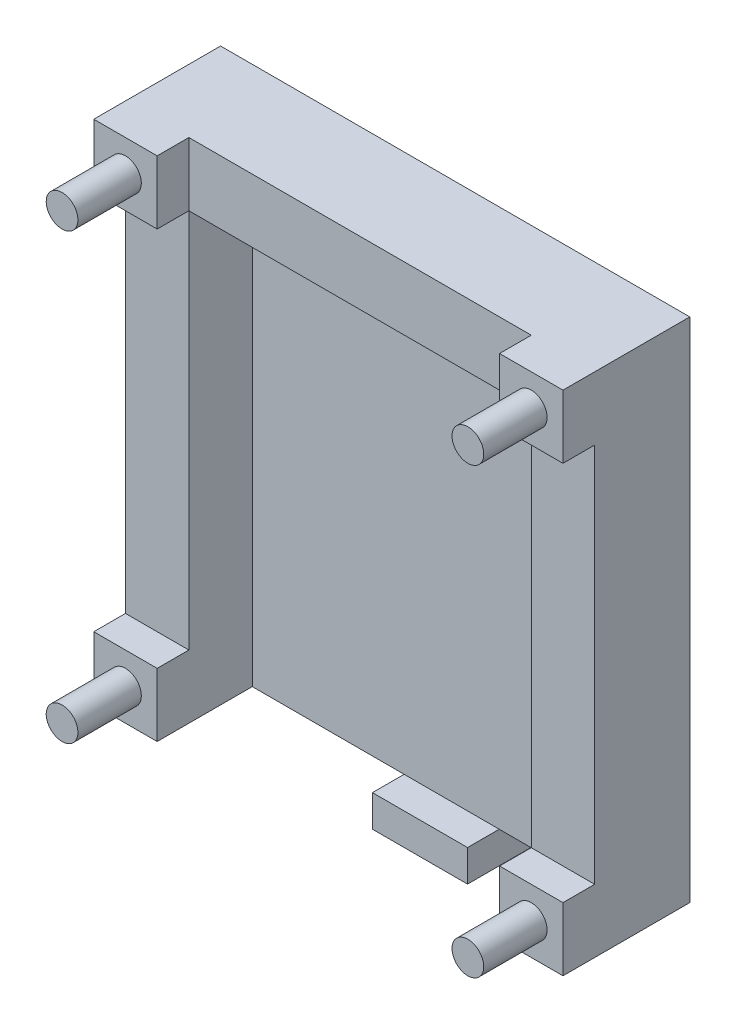
ISO-10303-21;
HEADER;
FILE_DESCRIPTION(('STEP AP214'),'2;1');
FILE_NAME('part.step','',(''),(''),'','','');
FILE_SCHEMA(('AUTOMOTIVE_DESIGN { 1 0 10303 214 1 1 1 1 }'));
ENDSEC;
DATA;
#1=APPLICATION_CONTEXT('core data for automotive mechanical design processes');
#2=APPLICATION_PROTOCOL_DEFINITION('international standard','automotive_design',2000,#1);
#3=PRODUCT_CONTEXT('',#1,'mechanical');
#4=PRODUCT('Part','Part','',(#3));
#5=PRODUCT_RELATED_PRODUCT_CATEGORY('part','',(#4));
#6=PRODUCT_DEFINITION_FORMATION('','',#4);
#7=PRODUCT_DEFINITION_CONTEXT('part definition',#1,'design');
#8=PRODUCT_DEFINITION('design','',#6,#7);
#9=PRODUCT_DEFINITION_SHAPE('','',#8);
#10=(LENGTH_UNIT() NAMED_UNIT(*) SI_UNIT(.MILLI.,.METRE.));
#11=(NAMED_UNIT(*) PLANE_ANGLE_UNIT() SI_UNIT($,.RADIAN.));
#12=(NAMED_UNIT(*) SI_UNIT($,.STERADIAN.) SOLID_ANGLE_UNIT());
#13=UNCERTAINTY_MEASURE_WITH_UNIT(LENGTH_MEASURE(1.E-05),#10,'distance_accuracy_value','');
#14=(GEOMETRIC_REPRESENTATION_CONTEXT(3) GLOBAL_UNCERTAINTY_ASSIGNED_CONTEXT((#13)) GLOBAL_UNIT_ASSIGNED_CONTEXT((#10,
#11,#12)) REPRESENTATION_CONTEXT('',''));
#15=CARTESIAN_POINT('',(0.,0.,0.));
#16=DIRECTION('',(0.,0.,1.));
#17=DIRECTION('',(1.,0.,0.));
#18=AXIS2_PLACEMENT_3D('',#15,#16,#17);
#19=CARTESIAN_POINT('',(0.,-38.4913625304137,10.));
#20=DIRECTION('',(0.,1.,0.));
#21=DIRECTION('',(-1.,0.,0.));
#22=AXIS2_PLACEMENT_3D('',#19,#20,#21);
#23=PLANE('',#22);
#24=DIRECTION('',(1.,0.,0.));
#25=VECTOR('',#24,1.);
#26=CARTESIAN_POINT('',(0.,-38.4913625304137,0.));
#27=LINE('',#26,#25);
#28=CARTESIAN_POINT('',(25.3489672837016,-38.4913625304136,0.));
#29=VERTEX_POINT('',#28);
#30=CARTESIAN_POINT('',(40.3489672837016,-38.4913625304136,0.));
#31=VERTEX_POINT('',#30);
#32=EDGE_CURVE('E111',#29,#31,#27,.T.);
#33=ORIENTED_EDGE('',*,*,#32,.T.);
#34=DIRECTION('',(0.,0.,-1.));
#35=VECTOR('',#34,1.);
#36=CARTESIAN_POINT('',(40.3489672837016,-38.4913625304136,10.));
#37=LINE('',#36,#35);
#38=CARTESIAN_POINT('',(40.3489672837016,-38.4913625304136,10.));
#39=VERTEX_POINT('',#38);
#40=EDGE_CURVE('E12',#39,#31,#37,.T.);
#41=ORIENTED_EDGE('',*,*,#40,.F.);
#42=DIRECTION('',(1.,0.,0.));
#43=VECTOR('',#42,1.);
#44=CARTESIAN_POINT('',(0.,-38.4913625304137,10.));
#45=LINE('',#44,#43);
#46=CARTESIAN_POINT('',(25.3489672837016,-38.4913625304136,10.));
#47=VERTEX_POINT('',#46);
#48=EDGE_CURVE('E106',#47,#39,#45,.T.);
#49=ORIENTED_EDGE('',*,*,#48,.F.);
#50=DIRECTION('',(0.,0.,-1.));
#51=VECTOR('',#50,1.);
#52=CARTESIAN_POINT('',(25.3489672837016,-38.4913625304136,10.));
#53=LINE('',#52,#51);
#54=EDGE_CURVE('E50',#47,#29,#53,.T.);
#55=ORIENTED_EDGE('',*,*,#54,.T.);
#56=EDGE_LOOP('',(#33,#41,#49,#55));
#57=FACE_BOUND('',#56,.T.);
#58=ADVANCED_FACE('F47',(#57),#23,.F.);
#59=CARTESIAN_POINT('',(40.3489672837016,0.,10.));
#60=DIRECTION('',(-1.,0.,0.));
#61=DIRECTION('',(0.,0.,1.));
#62=AXIS2_PLACEMENT_3D('',#59,#60,#61);
#63=PLANE('',#62);
#64=DIRECTION('',(0.,1.,0.));
#65=VECTOR('',#64,1.);
#66=CARTESIAN_POINT('',(40.3489672837016,0.,0.));
#67=LINE('',#66,#65);
#68=CARTESIAN_POINT('',(40.3489672837016,-33.4913625304136,0.));
#69=VERTEX_POINT('',#68);
#70=EDGE_CURVE('E78',#31,#69,#67,.T.);
#71=ORIENTED_EDGE('',*,*,#70,.T.);
#72=DIRECTION('',(0.,0.,-1.));
#73=VECTOR('',#72,1.);
#74=CARTESIAN_POINT('',(40.3489672837016,-33.4913625304136,10.));
#75=LINE('',#74,#73);
#76=CARTESIAN_POINT('',(40.3489672837016,-33.4913625304136,10.));
#77=VERTEX_POINT('',#76);
#78=EDGE_CURVE('E56',#77,#69,#75,.T.);
#79=ORIENTED_EDGE('',*,*,#78,.F.);
#80=DIRECTION('',(0.,1.,0.));
#81=VECTOR('',#80,1.);
#82=CARTESIAN_POINT('',(40.3489672837016,0.,10.));
#83=LINE('',#82,#81);
#84=EDGE_CURVE('E64',#39,#77,#83,.T.);
#85=ORIENTED_EDGE('',*,*,#84,.F.);
#86=ORIENTED_EDGE('',*,*,#40,.T.);
#87=EDGE_LOOP('',(#71,#79,#85,#86));
#88=FACE_BOUND('',#87,.T.);
#89=ADVANCED_FACE('F121',(#88),#63,.F.);
#90=CARTESIAN_POINT('',(0.,-33.4913625304136,10.));
#91=DIRECTION('',(0.,-1.,0.));
#92=DIRECTION('',(1.,0.,0.));
#93=AXIS2_PLACEMENT_3D('',#90,#91,#92);
#94=PLANE('',#93);
#95=DIRECTION('',(-1.,0.,0.));
#96=VECTOR('',#95,1.);
#97=CARTESIAN_POINT('',(0.,-33.4913625304136,0.));
#98=LINE('',#97,#96);
#99=CARTESIAN_POINT('',(25.3489672837016,-33.4913625304136,0.));
#100=VERTEX_POINT('',#99);
#101=EDGE_CURVE('E100',#69,#100,#98,.T.);
#102=ORIENTED_EDGE('',*,*,#101,.T.);
#103=DIRECTION('',(0.,0.,-1.));
#104=VECTOR('',#103,1.);
#105=CARTESIAN_POINT('',(25.3489672837016,-33.4913625304136,10.));
#106=LINE('',#105,#104);
#107=CARTESIAN_POINT('',(25.3489672837016,-33.4913625304136,10.));
#108=VERTEX_POINT('',#107);
#109=EDGE_CURVE('E98',#108,#100,#106,.T.);
#110=ORIENTED_EDGE('',*,*,#109,.F.);
#111=DIRECTION('',(-1.,0.,0.));
#112=VECTOR('',#111,1.);
#113=CARTESIAN_POINT('',(0.,-33.4913625304136,10.));
#114=LINE('',#113,#112);
#115=EDGE_CURVE('E92',#77,#108,#114,.T.);
#116=ORIENTED_EDGE('',*,*,#115,.F.);
#117=ORIENTED_EDGE('',*,*,#78,.T.);
#118=EDGE_LOOP('',(#102,#110,#116,#117));
#119=FACE_BOUND('',#118,.T.);
#120=ADVANCED_FACE('F99',(#119),#94,.F.);
#121=CARTESIAN_POINT('',(25.3489672837016,0.,10.));
#122=DIRECTION('',(1.,0.,0.));
#123=DIRECTION('',(0.,0.,-1.));
#124=AXIS2_PLACEMENT_3D('',#121,#122,#123);
#125=PLANE('',#124);
#126=DIRECTION('',(0.,-1.,0.));
#127=VECTOR('',#126,1.);
#128=CARTESIAN_POINT('',(25.3489672837016,0.,0.));
#129=LINE('',#128,#127);
#130=EDGE_CURVE('E114',#100,#29,#129,.T.);
#131=ORIENTED_EDGE('',*,*,#130,.T.);
#132=ORIENTED_EDGE('',*,*,#54,.F.);
#133=DIRECTION('',(0.,-1.,0.));
#134=VECTOR('',#133,1.);
#135=CARTESIAN_POINT('',(25.3489672837016,0.,10.));
#136=LINE('',#135,#134);
#137=EDGE_CURVE('E89',#108,#47,#136,.T.);
#138=ORIENTED_EDGE('',*,*,#137,.F.);
#139=ORIENTED_EDGE('',*,*,#109,.T.);
#140=EDGE_LOOP('',(#131,#132,#138,#139));
#141=FACE_BOUND('',#140,.T.);
#142=ADVANCED_FACE('F103',(#141),#125,.F.);
#143=CARTESIAN_POINT('',(0.,0.,10.));
#144=DIRECTION('',(0.,0.,-1.));
#145=DIRECTION('',(-1.,0.,0.));
#146=AXIS2_PLACEMENT_3D('',#143,#144,#145);
#147=PLANE('',#146);
#148=ORIENTED_EDGE('',*,*,#48,.T.);
#149=ORIENTED_EDGE('',*,*,#84,.T.);
#150=ORIENTED_EDGE('',*,*,#115,.T.);
#151=ORIENTED_EDGE('',*,*,#137,.T.);
#152=EDGE_LOOP('',(#148,#149,#150,#151));
#153=FACE_BOUND('',#152,.T.);
#154=ADVANCED_FACE('F94',(#153),#147,.F.);
#155=CARTESIAN_POINT('',(0.,0.,0.));
#156=DIRECTION('',(0.,0.,-1.));
#157=DIRECTION('',(-1.,0.,0.));
#158=AXIS2_PLACEMENT_3D('',#155,#156,#157);
#159=PLANE('',#158);
#160=ORIENTED_EDGE('',*,*,#32,.F.);
#161=ORIENTED_EDGE('',*,*,#130,.F.);
#162=ORIENTED_EDGE('',*,*,#101,.F.);
#163=ORIENTED_EDGE('',*,*,#70,.F.);
#164=EDGE_LOOP('',(#160,#161,#162,#163));
#165=FACE_BOUND('',#164,.T.);
#166=ADVANCED_FACE('F118',(#165),#159,.T.);
#167=CLOSED_SHELL('',(#58,#89,#120,#142,#154,#166));
#168=MANIFOLD_SOLID_BREP('B2',#167);
#169=CARTESIAN_POINT('',(0.,0.,20.));
#170=DIRECTION('',(0.,0.,-1.));
#171=DIRECTION('',(-1.,0.,0.));
#172=AXIS2_PLACEMENT_3D('',#169,#170,#171);
#173=PLANE('',#172);
#174=DIRECTION('',(-1.,0.,0.));
#175=VECTOR('',#174,1.);
#176=CARTESIAN_POINT('',(0.,-23.4913625304136,20.));
#177=LINE('',#176,#175);
#178=CARTESIAN_POINT('',(65.4005438109229,-23.4913625304136,20.));
#179=VERTEX_POINT('',#178);
#180=CARTESIAN_POINT('',(55.4005438109229,-23.4913625304136,20.));
#181=VERTEX_POINT('',#180);
#182=EDGE_CURVE('E352',#179,#181,#177,.T.);
#183=ORIENTED_EDGE('',*,*,#182,.T.);
#184=DIRECTION('',(0.,-1.,0.));
#185=VECTOR('',#184,1.);
#186=CARTESIAN_POINT('',(55.4005438109229,0.,20.));
#187=LINE('',#186,#185);
#188=CARTESIAN_POINT('',(55.4005438109229,-33.4913625304136,20.));
#189=VERTEX_POINT('',#188);
#190=EDGE_CURVE('E368',#181,#189,#187,.T.);
#191=ORIENTED_EDGE('',*,*,#190,.T.);
#192=DIRECTION('',(1.,0.,0.));
#193=VECTOR('',#192,1.);
#194=CARTESIAN_POINT('',(0.,-33.4913625304136,20.));
#195=LINE('',#194,#193);
#196=CARTESIAN_POINT('',(65.4005438109229,-33.4913625304136,20.));
#197=VERTEX_POINT('',#196);
#198=EDGE_CURVE('E366',#189,#197,#195,.T.);
#199=ORIENTED_EDGE('',*,*,#198,.T.);
#200=DIRECTION('',(0.,1.,0.));
#201=VECTOR('',#200,1.);
#202=CARTESIAN_POINT('',(65.4005438109229,0.,20.));
#203=LINE('',#202,#201);
#204=EDGE_CURVE('E364',#197,#179,#203,.T.);
#205=ORIENTED_EDGE('',*,*,#204,.T.);
#206=EDGE_LOOP('',(#183,#191,#199,#205));
#207=FACE_BOUND('',#206,.T.);
#208=CARTESIAN_POINT('',(60.4005438109229,-28.4913625304136,20.));
#209=DIRECTION('',(0.,0.,-1.));
#210=DIRECTION('',(-1.,0.,0.));
#211=AXIS2_PLACEMENT_3D('',#208,#209,#210);
#212=CIRCLE('',#211,2.5);
#213=CARTESIAN_POINT('',(57.9005438109229,-28.4913625304136,20.));
#214=VERTEX_POINT('',#213);
#215=EDGE_CURVE('E45',#214,#214,#212,.F.);
#216=ORIENTED_EDGE('',*,*,#215,.F.);
#217=EDGE_LOOP('',(#216));
#218=FACE_BOUND('',#217,.T.);
#219=ADVANCED_FACE('F180',(#207,#218),#173,.F.);
#220=CARTESIAN_POINT('',(0.,0.,20.));
#221=DIRECTION('',(0.,0.,-1.));
#222=DIRECTION('',(-1.,0.,0.));
#223=AXIS2_PLACEMENT_3D('',#220,#221,#222);
#224=PLANE('',#223);
#225=DIRECTION('',(-1.,0.,0.));
#226=VECTOR('',#225,1.);
#227=CARTESIAN_POINT('',(0.,46.5086374695864,20.));
#228=LINE('',#227,#226);
#229=CARTESIAN_POINT('',(1.40054381092291,46.5086374695864,20.));
#230=VERTEX_POINT('',#229);
#231=CARTESIAN_POINT('',(-8.59945618907708,46.5086374695864,20.));
#232=VERTEX_POINT('',#231);
#233=EDGE_CURVE('E303',#230,#232,#228,.T.);
#234=ORIENTED_EDGE('',*,*,#233,.T.);
#235=DIRECTION('',(0.,-1.,0.));
#236=VECTOR('',#235,1.);
#237=CARTESIAN_POINT('',(-8.59945618907708,0.,20.));
#238=LINE('',#237,#236);
#239=CARTESIAN_POINT('',(-8.59945618907708,36.5086374695864,20.));
#240=VERTEX_POINT('',#239);
#241=EDGE_CURVE('E319',#232,#240,#238,.T.);
#242=ORIENTED_EDGE('',*,*,#241,.T.);
#243=DIRECTION('',(1.,0.,0.));
#244=VECTOR('',#243,1.);
#245=CARTESIAN_POINT('',(0.,36.5086374695864,20.));
#246=LINE('',#245,#244);
#247=CARTESIAN_POINT('',(1.40054381092291,36.5086374695864,20.));
#248=VERTEX_POINT('',#247);
#249=EDGE_CURVE('E306',#240,#248,#246,.T.);
#250=ORIENTED_EDGE('',*,*,#249,.T.);
#251=DIRECTION('',(0.,1.,0.));
#252=VECTOR('',#251,1.);
#253=CARTESIAN_POINT('',(1.40054381092291,0.,20.));
#254=LINE('',#253,#252);
#255=EDGE_CURVE('E298',#248,#230,#254,.T.);
#256=ORIENTED_EDGE('',*,*,#255,.T.);
#257=EDGE_LOOP('',(#234,#242,#250,#256));
#258=FACE_BOUND('',#257,.T.);
#259=CARTESIAN_POINT('',(-3.59945618907709,41.5086374695864,20.));
#260=DIRECTION('',(0.,0.,-1.));
#261=DIRECTION('',(-1.,0.,0.));
#262=AXIS2_PLACEMENT_3D('',#259,#260,#261);
#263=CIRCLE('',#262,2.5);
#264=CARTESIAN_POINT('',(-6.09945618907709,41.5086374695864,20.));
#265=VERTEX_POINT('',#264);
#266=EDGE_CURVE('E188',#265,#265,#263,.F.);
#267=ORIENTED_EDGE('',*,*,#266,.F.);
#268=EDGE_LOOP('',(#267));
#269=FACE_BOUND('',#268,.T.);
#270=ADVANCED_FACE('F300',(#258,#269),#224,.F.);
#271=CARTESIAN_POINT('',(1.40054381092291,36.5086374695864,15.));
#272=DIRECTION('',(0.,-1.,0.));
#273=DIRECTION('',(0.,0.,-1.));
#274=AXIS2_PLACEMENT_3D('',#271,#272,#273);
#275=PLANE('',#274);
#276=DIRECTION('',(-1.,0.,0.));
#277=VECTOR('',#276,1.);
#278=CARTESIAN_POINT('',(1.40054381092291,36.5086374695864,15.));
#279=LINE('',#278,#277);
#280=CARTESIAN_POINT('',(55.4005438109229,36.5086374695864,15.));
#281=VERTEX_POINT('',#280);
#282=CARTESIAN_POINT('',(1.40054381092291,36.5086374695864,15.));
#283=VERTEX_POINT('',#282);
#284=EDGE_CURVE('E411',#281,#283,#279,.T.);
#285=ORIENTED_EDGE('',*,*,#284,.T.);
#286=DIRECTION('',(0.,0.,-1.));
#287=VECTOR('',#286,1.);
#288=CARTESIAN_POINT('',(1.40054381092291,36.5086374695864,15.));
#289=LINE('',#288,#287);
#290=CARTESIAN_POINT('',(1.40054381092291,36.5086374695864,5.));
#291=VERTEX_POINT('',#290);
#292=EDGE_CURVE('E441',#283,#291,#289,.T.);
#293=ORIENTED_EDGE('',*,*,#292,.T.);
#294=DIRECTION('',(-1.,0.,0.));
#295=VECTOR('',#294,1.);
#296=CARTESIAN_POINT('',(1.40054381092291,36.5086374695864,5.));
#297=LINE('',#296,#295);
#298=CARTESIAN_POINT('',(55.4005438109229,36.5086374695864,5.));
#299=VERTEX_POINT('',#298);
#300=EDGE_CURVE('E444',#299,#291,#297,.T.);
#301=ORIENTED_EDGE('',*,*,#300,.F.);
#302=DIRECTION('',(0.,0.,-1.));
#303=VECTOR('',#302,1.);
#304=CARTESIAN_POINT('',(55.4005438109229,36.5086374695864,15.));
#305=LINE('',#304,#303);
#306=EDGE_CURVE('E325',#281,#299,#305,.T.);
#307=ORIENTED_EDGE('',*,*,#306,.F.);
#308=EDGE_LOOP('',(#285,#293,#301,#307));
#309=FACE_BOUND('',#308,.T.);
#310=ADVANCED_FACE('F572',(#309),#275,.T.);
#311=DIRECTION('',(0.,0.,-1.));
#312=VECTOR('',#311,1.);
#313=CARTESIAN_POINT('',(-8.59945618907708,36.5086374695864,20.));
#314=LINE('',#313,#312);
#315=CARTESIAN_POINT('',(-8.59945618907708,36.5086374695864,15.));
#316=VERTEX_POINT('',#315);
#317=EDGE_CURVE('E336',#240,#316,#314,.T.);
#318=ORIENTED_EDGE('',*,*,#317,.T.);
#319=DIRECTION('',(-1.,0.,0.));
#320=VECTOR('',#319,1.);
#321=CARTESIAN_POINT('',(0.,36.5086374695864,15.));
#322=LINE('',#321,#320);
#323=EDGE_CURVE('E488',#283,#316,#322,.T.);
#324=ORIENTED_EDGE('',*,*,#323,.F.);
#325=DIRECTION('',(0.,0.,-1.));
#326=VECTOR('',#325,1.);
#327=CARTESIAN_POINT('',(1.40054381092291,36.5086374695864,20.));
#328=LINE('',#327,#326);
#329=EDGE_CURVE('E318',#248,#283,#328,.T.);
#330=ORIENTED_EDGE('',*,*,#329,.F.);
#331=ORIENTED_EDGE('',*,*,#249,.F.);
#332=EDGE_LOOP('',(#318,#324,#330,#331));
#333=FACE_BOUND('',#332,.T.);
#334=ADVANCED_FACE('F487',(#333),#275,.T.);
#335=CARTESIAN_POINT('',(0.,-23.4913625304136,20.));
#336=DIRECTION('',(0.,1.,0.));
#337=DIRECTION('',(-1.,0.,0.));
#338=AXIS2_PLACEMENT_3D('',#335,#336,#337);
#339=PLANE('',#338);
#340=DIRECTION('',(0.,0.,-1.));
#341=VECTOR('',#340,1.);
#342=CARTESIAN_POINT('',(1.40054381092291,-23.4913625304136,20.));
#343=LINE('',#342,#341);
#344=CARTESIAN_POINT('',(1.40054381092291,-23.4913625304136,20.));
#345=VERTEX_POINT('',#344);
#346=CARTESIAN_POINT('',(1.40054381092291,-23.4913625304136,15.));
#347=VERTEX_POINT('',#346);
#348=EDGE_CURVE('E195',#345,#347,#343,.T.);
#349=ORIENTED_EDGE('',*,*,#348,.T.);
#350=DIRECTION('',(1.,0.,0.));
#351=VECTOR('',#350,1.);
#352=CARTESIAN_POINT('',(0.,-23.4913625304136,15.));
#353=LINE('',#352,#351);
#354=CARTESIAN_POINT('',(-8.59945618907709,-23.4913625304136,15.));
#355=VERTEX_POINT('',#354);
#356=EDGE_CURVE('E199',#355,#347,#353,.T.);
#357=ORIENTED_EDGE('',*,*,#356,.F.);
#358=DIRECTION('',(0.,0.,-1.));
#359=VECTOR('',#358,1.);
#360=CARTESIAN_POINT('',(-8.59945618907709,-23.4913625304136,20.));
#361=LINE('',#360,#359);
#362=CARTESIAN_POINT('',(-8.59945618907709,-23.4913625304136,20.));
#363=VERTEX_POINT('',#362);
#364=EDGE_CURVE('E353',#363,#355,#361,.T.);
#365=ORIENTED_EDGE('',*,*,#364,.F.);
#366=DIRECTION('',(1.,0.,0.));
#367=VECTOR('',#366,1.);
#368=CARTESIAN_POINT('',(0.,-23.4913625304136,20.));
#369=LINE('',#368,#367);
#370=EDGE_CURVE('E347',#363,#345,#369,.T.);
#371=ORIENTED_EDGE('',*,*,#370,.T.);
#372=EDGE_LOOP('',(#349,#357,#365,#371));
#373=FACE_BOUND('',#372,.T.);
#374=ADVANCED_FACE('F849',(#373),#339,.T.);
#375=DIRECTION('',(0.,0.,-1.));
#376=VECTOR('',#375,1.);
#377=CARTESIAN_POINT('',(55.4005438109229,36.5086374695864,20.));
#378=LINE('',#377,#376);
#379=CARTESIAN_POINT('',(55.4005438109229,36.5086374695864,20.));
#380=VERTEX_POINT('',#379);
#381=EDGE_CURVE('E408',#380,#281,#378,.T.);
#382=ORIENTED_EDGE('',*,*,#381,.T.);
#383=DIRECTION('',(-1.,0.,0.));
#384=VECTOR('',#383,1.);
#385=CARTESIAN_POINT('',(0.,36.5086374695864,15.));
#386=LINE('',#385,#384);
#387=CARTESIAN_POINT('',(65.4005438109229,36.5086374695864,15.));
#388=VERTEX_POINT('',#387);
#389=EDGE_CURVE('E437',#388,#281,#386,.T.);
#390=ORIENTED_EDGE('',*,*,#389,.F.);
#391=DIRECTION('',(0.,0.,-1.));
#392=VECTOR('',#391,1.);
#393=CARTESIAN_POINT('',(65.4005438109229,36.5086374695864,20.));
#394=LINE('',#393,#392);
#395=CARTESIAN_POINT('',(65.4005438109229,36.5086374695864,20.));
#396=VERTEX_POINT('',#395);
#397=EDGE_CURVE('E393',#396,#388,#394,.T.);
#398=ORIENTED_EDGE('',*,*,#397,.F.);
#399=DIRECTION('',(-1.,0.,0.));
#400=VECTOR('',#399,1.);
#401=CARTESIAN_POINT('',(0.,36.5086374695864,20.));
#402=LINE('',#401,#400);
#403=EDGE_CURVE('E385',#396,#380,#402,.T.);
#404=ORIENTED_EDGE('',*,*,#403,.T.);
#405=EDGE_LOOP('',(#382,#390,#398,#404));
#406=FACE_BOUND('',#405,.T.);
#407=ADVANCED_FACE('F519',(#406),#275,.T.);
#408=CARTESIAN_POINT('',(0.,-23.4913625304136,20.));
#409=DIRECTION('',(0.,-1.,0.));
#410=DIRECTION('',(0.,0.,-1.));
#411=AXIS2_PLACEMENT_3D('',#408,#409,#410);
#412=PLANE('',#411);
#413=DIRECTION('',(1.,0.,0.));
#414=VECTOR('',#413,1.);
#415=CARTESIAN_POINT('',(0.,-23.4913625304136,15.));
#416=LINE('',#415,#414);
#417=CARTESIAN_POINT('',(55.4005438109229,-23.4913625304136,15.));
#418=VERTEX_POINT('',#417);
#419=CARTESIAN_POINT('',(65.4005438109229,-23.4913625304136,15.));
#420=VERTEX_POINT('',#419);
#421=EDGE_CURVE('E434',#418,#420,#416,.T.);
#422=ORIENTED_EDGE('',*,*,#421,.F.);
#423=DIRECTION('',(0.,0.,-1.));
#424=VECTOR('',#423,1.);
#425=CARTESIAN_POINT('',(55.4005438109229,-23.4913625304136,20.));
#426=LINE('',#425,#424);
#427=EDGE_CURVE('E371',#181,#418,#426,.T.);
#428=ORIENTED_EDGE('',*,*,#427,.F.);
#429=ORIENTED_EDGE('',*,*,#182,.F.);
#430=DIRECTION('',(0.,0.,-1.));
#431=VECTOR('',#430,1.);
#432=CARTESIAN_POINT('',(65.4005438109229,-23.4913625304136,20.));
#433=LINE('',#432,#431);
#434=EDGE_CURVE('E370',#179,#420,#433,.T.);
#435=ORIENTED_EDGE('',*,*,#434,.T.);
#436=EDGE_LOOP('',(#422,#428,#429,#435));
#437=FACE_BOUND('',#436,.T.);
#438=ADVANCED_FACE('F526',(#437),#412,.F.);
#439=CARTESIAN_POINT('',(55.4005438109229,-33.4913625304136,5.));
#440=DIRECTION('',(0.,1.,0.));
#441=DIRECTION('',(-1.,0.,0.));
#442=AXIS2_PLACEMENT_3D('',#439,#440,#441);
#443=PLANE('',#442);
#444=DIRECTION('',(1.,0.,0.));
#445=VECTOR('',#444,1.);
#446=CARTESIAN_POINT('',(55.4005438109229,-33.4913625304136,0.));
#447=LINE('',#446,#445);
#448=CARTESIAN_POINT('',(-8.59945618907709,-33.4913625304136,0.));
#449=VERTEX_POINT('',#448);
#450=CARTESIAN_POINT('',(65.4005438109229,-33.4913625304136,0.));
#451=VERTEX_POINT('',#450);
#452=EDGE_CURVE('E420',#449,#451,#447,.T.);
#453=ORIENTED_EDGE('',*,*,#452,.T.);
#454=DIRECTION('',(0.,0.,-1.));
#455=VECTOR('',#454,1.);
#456=CARTESIAN_POINT('',(65.4005438109229,-33.4913625304136,20.));
#457=LINE('',#456,#455);
#458=EDGE_CURVE('E378',#197,#451,#457,.T.);
#459=ORIENTED_EDGE('',*,*,#458,.F.);
#460=ORIENTED_EDGE('',*,*,#198,.F.);
#461=DIRECTION('',(0.,0.,-1.));
#462=VECTOR('',#461,1.);
#463=CARTESIAN_POINT('',(55.4005438109229,-33.4913625304136,20.));
#464=LINE('',#463,#462);
#465=CARTESIAN_POINT('',(55.4005438109229,-33.4913625304136,5.));
#466=VERTEX_POINT('',#465);
#467=EDGE_CURVE('E375',#189,#466,#464,.T.);
#468=ORIENTED_EDGE('',*,*,#467,.T.);
#469=DIRECTION('',(1.,0.,0.));
#470=VECTOR('',#469,1.);
#471=CARTESIAN_POINT('',(55.4005438109229,-33.4913625304136,5.));
#472=LINE('',#471,#470);
#473=CARTESIAN_POINT('',(1.40054381092291,-33.4913625304136,5.));
#474=VERTEX_POINT('',#473);
#475=EDGE_CURVE('E426',#474,#466,#472,.T.);
#476=ORIENTED_EDGE('',*,*,#475,.F.);
#477=DIRECTION('',(0.,0.,-1.));
#478=VECTOR('',#477,1.);
#479=CARTESIAN_POINT('',(1.40054381092291,-33.4913625304136,20.));
#480=LINE('',#479,#478);
#481=CARTESIAN_POINT('',(1.40054381092291,-33.4913625304136,20.));
#482=VERTEX_POINT('',#481);
#483=EDGE_CURVE('E349',#482,#474,#480,.T.);
#484=ORIENTED_EDGE('',*,*,#483,.F.);
#485=DIRECTION('',(-1.,0.,0.));
#486=VECTOR('',#485,1.);
#487=CARTESIAN_POINT('',(0.,-33.4913625304136,20.));
#488=LINE('',#487,#486);
#489=CARTESIAN_POINT('',(-8.59945618907709,-33.4913625304136,20.));
#490=VERTEX_POINT('',#489);
#491=EDGE_CURVE('E341',#482,#490,#488,.T.);
#492=ORIENTED_EDGE('',*,*,#491,.T.);
#493=DIRECTION('',(0.,0.,-1.));
#494=VECTOR('',#493,1.);
#495=CARTESIAN_POINT('',(-8.59945618907709,-33.4913625304136,20.));
#496=LINE('',#495,#494);
#497=EDGE_CURVE('E355',#490,#449,#496,.T.);
#498=ORIENTED_EDGE('',*,*,#497,.T.);
#499=EDGE_LOOP('',(#453,#459,#460,#468,#476,#484,#492,#498));
#500=FACE_BOUND('',#499,.T.);
#501=ADVANCED_FACE('F182',(#500),#443,.F.);
#502=CARTESIAN_POINT('',(0.,0.,5.));
#503=DIRECTION('',(0.,0.,-1.));
#504=DIRECTION('',(-1.,0.,0.));
#505=AXIS2_PLACEMENT_3D('',#502,#503,#504);
#506=PLANE('',#505);
#507=DIRECTION('',(0.,-1.,0.));
#508=VECTOR('',#507,1.);
#509=CARTESIAN_POINT('',(1.40054381092291,-33.4913625304136,5.));
#510=LINE('',#509,#508);
#511=EDGE_CURVE('E429',#291,#474,#510,.T.);
#512=ORIENTED_EDGE('',*,*,#511,.T.);
#513=ORIENTED_EDGE('',*,*,#475,.T.);
#514=DIRECTION('',(0.,1.,0.));
#515=VECTOR('',#514,1.);
#516=CARTESIAN_POINT('',(55.4005438109229,36.5086374695864,5.));
#517=LINE('',#516,#515);
#518=EDGE_CURVE('E428',#466,#299,#517,.T.);
#519=ORIENTED_EDGE('',*,*,#518,.T.);
#520=ORIENTED_EDGE('',*,*,#300,.T.);
#521=EDGE_LOOP('',(#512,#513,#519,#520));
#522=FACE_BOUND('',#521,.T.);
#523=ADVANCED_FACE('F598',(#522),#506,.F.);
#524=CARTESIAN_POINT('',(0.,0.,0.));
#525=DIRECTION('',(0.,0.,-1.));
#526=DIRECTION('',(-1.,0.,0.));
#527=AXIS2_PLACEMENT_3D('',#524,#525,#526);
#528=PLANE('',#527);
#529=DIRECTION('',(0.,1.,0.));
#530=VECTOR('',#529,1.);
#531=CARTESIAN_POINT('',(-8.59945618907709,0.,0.));
#532=LINE('',#531,#530);
#533=CARTESIAN_POINT('',(-8.59945618907708,46.5086374695864,0.));
#534=VERTEX_POINT('',#533);
#535=EDGE_CURVE('E335',#449,#534,#532,.T.);
#536=ORIENTED_EDGE('',*,*,#535,.T.);
#537=DIRECTION('',(1.,0.,0.));
#538=VECTOR('',#537,1.);
#539=CARTESIAN_POINT('',(55.4005438109229,46.5086374695864,0.));
#540=LINE('',#539,#538);
#541=CARTESIAN_POINT('',(65.4005438109229,46.5086374695864,0.));
#542=VERTEX_POINT('',#541);
#543=EDGE_CURVE('E398',#534,#542,#540,.T.);
#544=ORIENTED_EDGE('',*,*,#543,.T.);
#545=DIRECTION('',(0.,-1.,0.));
#546=VECTOR('',#545,1.);
#547=CARTESIAN_POINT('',(65.4005438109229,0.,0.));
#548=LINE('',#547,#546);
#549=EDGE_CURVE('E374',#542,#451,#548,.T.);
#550=ORIENTED_EDGE('',*,*,#549,.T.);
#551=ORIENTED_EDGE('',*,*,#452,.F.);
#552=EDGE_LOOP('',(#536,#544,#550,#551));
#553=FACE_BOUND('',#552,.T.);
#554=ADVANCED_FACE('F464',(#553),#528,.T.);
#555=CARTESIAN_POINT('',(55.4005438109229,46.5086374695864,15.));
#556=DIRECTION('',(0.,1.,0.));
#557=DIRECTION('',(0.,0.,1.));
#558=AXIS2_PLACEMENT_3D('',#555,#556,#557);
#559=PLANE('',#558);
#560=ORIENTED_EDGE('',*,*,#543,.F.);
#561=DIRECTION('',(0.,0.,-1.));
#562=VECTOR('',#561,1.);
#563=CARTESIAN_POINT('',(-8.59945618907708,46.5086374695864,20.));
#564=LINE('',#563,#562);
#565=EDGE_CURVE('E324',#232,#534,#564,.T.);
#566=ORIENTED_EDGE('',*,*,#565,.F.);
#567=ORIENTED_EDGE('',*,*,#233,.F.);
#568=DIRECTION('',(0.,0.,-1.));
#569=VECTOR('',#568,1.);
#570=CARTESIAN_POINT('',(1.40054381092291,46.5086374695864,20.));
#571=LINE('',#570,#569);
#572=CARTESIAN_POINT('',(1.40054381092291,46.5086374695864,15.));
#573=VERTEX_POINT('',#572);
#574=EDGE_CURVE('E313',#230,#573,#571,.T.);
#575=ORIENTED_EDGE('',*,*,#574,.T.);
#576=DIRECTION('',(1.,0.,0.));
#577=VECTOR('',#576,1.);
#578=CARTESIAN_POINT('',(55.4005438109229,46.5086374695864,15.));
#579=LINE('',#578,#577);
#580=CARTESIAN_POINT('',(55.4005438109229,46.5086374695864,15.));
#581=VERTEX_POINT('',#580);
#582=EDGE_CURVE('E410',#573,#581,#579,.T.);
#583=ORIENTED_EDGE('',*,*,#582,.T.);
#584=DIRECTION('',(0.,0.,-1.));
#585=VECTOR('',#584,1.);
#586=CARTESIAN_POINT('',(55.4005438109229,46.5086374695864,20.));
#587=LINE('',#586,#585);
#588=CARTESIAN_POINT('',(55.4005438109229,46.5086374695864,20.));
#589=VERTEX_POINT('',#588);
#590=EDGE_CURVE('E399',#589,#581,#587,.T.);
#591=ORIENTED_EDGE('',*,*,#590,.F.);
#592=DIRECTION('',(1.,0.,0.));
#593=VECTOR('',#592,1.);
#594=CARTESIAN_POINT('',(0.,46.5086374695864,20.));
#595=LINE('',#594,#593);
#596=CARTESIAN_POINT('',(65.4005438109229,46.5086374695864,20.));
#597=VERTEX_POINT('',#596);
#598=EDGE_CURVE('E390',#589,#597,#595,.T.);
#599=ORIENTED_EDGE('',*,*,#598,.T.);
#600=DIRECTION('',(0.,0.,-1.));
#601=VECTOR('',#600,1.);
#602=CARTESIAN_POINT('',(65.4005438109229,46.5086374695864,20.));
#603=LINE('',#602,#601);
#604=EDGE_CURVE('E395',#597,#542,#603,.T.);
#605=ORIENTED_EDGE('',*,*,#604,.T.);
#606=EDGE_LOOP('',(#560,#566,#567,#575,#583,#591,#599,#605));
#607=FACE_BOUND('',#606,.T.);
#608=ADVANCED_FACE('F322',(#607),#559,.T.);
#609=CARTESIAN_POINT('',(0.,0.,15.));
#610=DIRECTION('',(0.,0.,1.));
#611=DIRECTION('',(1.,0.,0.));
#612=AXIS2_PLACEMENT_3D('',#609,#610,#611);
#613=PLANE('',#612);
#614=ORIENTED_EDGE('',*,*,#284,.F.);
#615=DIRECTION('',(0.,-1.,0.));
#616=VECTOR('',#615,1.);
#617=CARTESIAN_POINT('',(55.4005438109229,36.5086374695864,15.));
#618=LINE('',#617,#616);
#619=EDGE_CURVE('E416',#581,#281,#618,.T.);
#620=ORIENTED_EDGE('',*,*,#619,.F.);
#621=ORIENTED_EDGE('',*,*,#582,.F.);
#622=DIRECTION('',(0.,1.,0.));
#623=VECTOR('',#622,1.);
#624=CARTESIAN_POINT('',(1.40054381092291,46.5086374695864,15.));
#625=LINE('',#624,#623);
#626=EDGE_CURVE('E316',#283,#573,#625,.T.);
#627=ORIENTED_EDGE('',*,*,#626,.F.);
#628=EDGE_LOOP('',(#614,#620,#621,#627));
#629=FACE_BOUND('',#628,.T.);
#630=ADVANCED_FACE('F588',(#629),#613,.T.);
#631=CARTESIAN_POINT('',(55.4005438109229,0.,20.));
#632=DIRECTION('',(1.,0.,0.));
#633=DIRECTION('',(0.,1.,0.));
#634=AXIS2_PLACEMENT_3D('',#631,#632,#633);
#635=PLANE('',#634);
#636=ORIENTED_EDGE('',*,*,#590,.T.);
#637=ORIENTED_EDGE('',*,*,#619,.T.);
#638=ORIENTED_EDGE('',*,*,#381,.F.);
#639=DIRECTION('',(0.,-1.,0.));
#640=VECTOR('',#639,1.);
#641=CARTESIAN_POINT('',(55.4005438109229,0.,20.));
#642=LINE('',#641,#640);
#643=EDGE_CURVE('E388',#589,#380,#642,.T.);
#644=ORIENTED_EDGE('',*,*,#643,.F.);
#645=EDGE_LOOP('',(#636,#637,#638,#644));
#646=FACE_BOUND('',#645,.T.);
#647=ADVANCED_FACE('F585',(#646),#635,.F.);
#648=CARTESIAN_POINT('',(65.4005438109229,0.,20.));
#649=DIRECTION('',(1.,0.,0.));
#650=DIRECTION('',(0.,0.,-1.));
#651=AXIS2_PLACEMENT_3D('',#648,#649,#650);
#652=PLANE('',#651);
#653=ORIENTED_EDGE('',*,*,#549,.F.);
#654=ORIENTED_EDGE('',*,*,#604,.F.);
#655=DIRECTION('',(0.,-1.,0.));
#656=VECTOR('',#655,1.);
#657=CARTESIAN_POINT('',(65.4005438109229,0.,20.));
#658=LINE('',#657,#656);
#659=EDGE_CURVE('E382',#597,#396,#658,.T.);
#660=ORIENTED_EDGE('',*,*,#659,.T.);
#661=ORIENTED_EDGE('',*,*,#397,.T.);
#662=DIRECTION('',(0.,-1.,0.));
#663=VECTOR('',#662,1.);
#664=CARTESIAN_POINT('',(65.4005438109229,0.,15.));
#665=LINE('',#664,#663);
#666=EDGE_CURVE('E440',#388,#420,#665,.T.);
#667=ORIENTED_EDGE('',*,*,#666,.T.);
#668=ORIENTED_EDGE('',*,*,#434,.F.);
#669=ORIENTED_EDGE('',*,*,#204,.F.);
#670=ORIENTED_EDGE('',*,*,#458,.T.);
#671=EDGE_LOOP('',(#653,#654,#660,#661,#667,#668,#669,#670));
#672=FACE_BOUND('',#671,.T.);
#673=ADVANCED_FACE('F471',(#672),#652,.T.);
#674=CARTESIAN_POINT('',(0.,0.,20.));
#675=DIRECTION('',(0.,0.,-1.));
#676=DIRECTION('',(-1.,0.,0.));
#677=AXIS2_PLACEMENT_3D('',#674,#675,#676);
#678=PLANE('',#677);
#679=CARTESIAN_POINT('',(60.4005438109229,41.5086374695864,20.));
#680=DIRECTION('',(0.,0.,1.));
#681=DIRECTION('',(1.,0.,0.));
#682=AXIS2_PLACEMENT_3D('',#679,#680,#681);
#683=CIRCLE('',#682,2.5);
#684=CARTESIAN_POINT('',(62.9005438109229,41.5086374695864,20.));
#685=VERTEX_POINT('',#684);
#686=EDGE_CURVE('E541',#685,#685,#683,.F.);
#687=ORIENTED_EDGE('',*,*,#686,.T.);
#688=EDGE_LOOP('',(#687));
#689=FACE_BOUND('',#688,.T.);
#690=ORIENTED_EDGE('',*,*,#659,.F.);
#691=ORIENTED_EDGE('',*,*,#598,.F.);
#692=ORIENTED_EDGE('',*,*,#643,.T.);
#693=ORIENTED_EDGE('',*,*,#403,.F.);
#694=EDGE_LOOP('',(#690,#691,#692,#693));
#695=FACE_BOUND('',#694,.T.);
#696=ADVANCED_FACE('F579',(#689,#695),#678,.F.);
#697=CARTESIAN_POINT('',(55.4005438109229,0.,20.));
#698=DIRECTION('',(1.,0.,0.));
#699=DIRECTION('',(0.,1.,0.));
#700=AXIS2_PLACEMENT_3D('',#697,#698,#699);
#701=PLANE('',#700);
#702=ORIENTED_EDGE('',*,*,#427,.T.);
#703=DIRECTION('',(0.,-1.,0.));
#704=VECTOR('',#703,1.);
#705=CARTESIAN_POINT('',(55.4005438109229,0.,15.));
#706=LINE('',#705,#704);
#707=EDGE_CURVE('E328',#281,#418,#706,.T.);
#708=ORIENTED_EDGE('',*,*,#707,.F.);
#709=ORIENTED_EDGE('',*,*,#306,.T.);
#710=ORIENTED_EDGE('',*,*,#518,.F.);
#711=ORIENTED_EDGE('',*,*,#467,.F.);
#712=ORIENTED_EDGE('',*,*,#190,.F.);
#713=EDGE_LOOP('',(#702,#708,#709,#710,#711,#712));
#714=FACE_BOUND('',#713,.T.);
#715=ADVANCED_FACE('F523',(#714),#701,.F.);
#716=CARTESIAN_POINT('',(1.40054381092291,0.,20.));
#717=DIRECTION('',(-1.,0.,0.));
#718=DIRECTION('',(0.,0.,1.));
#719=AXIS2_PLACEMENT_3D('',#716,#717,#718);
#720=PLANE('',#719);
#721=ORIENTED_EDGE('',*,*,#483,.T.);
#722=ORIENTED_EDGE('',*,*,#511,.F.);
#723=ORIENTED_EDGE('',*,*,#292,.F.);
#724=DIRECTION('',(0.,1.,0.));
#725=VECTOR('',#724,1.);
#726=CARTESIAN_POINT('',(1.40054381092291,0.,15.));
#727=LINE('',#726,#725);
#728=EDGE_CURVE('E492',#347,#283,#727,.T.);
#729=ORIENTED_EDGE('',*,*,#728,.F.);
#730=ORIENTED_EDGE('',*,*,#348,.F.);
#731=DIRECTION('',(0.,1.,0.));
#732=VECTOR('',#731,1.);
#733=CARTESIAN_POINT('',(1.40054381092291,0.,20.));
#734=LINE('',#733,#732);
#735=EDGE_CURVE('E339',#482,#345,#734,.T.);
#736=ORIENTED_EDGE('',*,*,#735,.F.);
#737=EDGE_LOOP('',(#721,#722,#723,#729,#730,#736));
#738=FACE_BOUND('',#737,.T.);
#739=ADVANCED_FACE('F497',(#738),#720,.F.);
#740=CARTESIAN_POINT('',(-8.59945618907709,0.,20.));
#741=DIRECTION('',(-1.,0.,0.));
#742=DIRECTION('',(0.,0.,1.));
#743=AXIS2_PLACEMENT_3D('',#740,#741,#742);
#744=PLANE('',#743);
#745=ORIENTED_EDGE('',*,*,#535,.F.);
#746=ORIENTED_EDGE('',*,*,#497,.F.);
#747=DIRECTION('',(0.,1.,0.));
#748=VECTOR('',#747,1.);
#749=CARTESIAN_POINT('',(-8.59945618907709,0.,20.));
#750=LINE('',#749,#748);
#751=EDGE_CURVE('E344',#490,#363,#750,.T.);
#752=ORIENTED_EDGE('',*,*,#751,.T.);
#753=ORIENTED_EDGE('',*,*,#364,.T.);
#754=DIRECTION('',(0.,-1.,0.));
#755=VECTOR('',#754,1.);
#756=CARTESIAN_POINT('',(-8.59945618907709,0.,15.));
#757=LINE('',#756,#755);
#758=EDGE_CURVE('E484',#316,#355,#757,.T.);
#759=ORIENTED_EDGE('',*,*,#758,.F.);
#760=ORIENTED_EDGE('',*,*,#317,.F.);
#761=ORIENTED_EDGE('',*,*,#241,.F.);
#762=ORIENTED_EDGE('',*,*,#565,.T.);
#763=EDGE_LOOP('',(#745,#746,#752,#753,#759,#760,#761,#762));
#764=FACE_BOUND('',#763,.T.);
#765=ADVANCED_FACE('F480',(#764),#744,.T.);
#766=CARTESIAN_POINT('',(0.,0.,20.));
#767=DIRECTION('',(0.,0.,-1.));
#768=DIRECTION('',(-1.,0.,0.));
#769=AXIS2_PLACEMENT_3D('',#766,#767,#768);
#770=PLANE('',#769);
#771=CARTESIAN_POINT('',(-3.59945618907709,-28.4913625304136,20.));
#772=DIRECTION('',(0.,0.,1.));
#773=DIRECTION('',(1.,0.,0.));
#774=AXIS2_PLACEMENT_3D('',#771,#772,#773);
#775=CIRCLE('',#774,2.5);
#776=CARTESIAN_POINT('',(-1.09945618907709,-28.4913625304136,20.));
#777=VERTEX_POINT('',#776);
#778=EDGE_CURVE('E550',#777,#777,#775,.F.);
#779=ORIENTED_EDGE('',*,*,#778,.T.);
#780=EDGE_LOOP('',(#779));
#781=FACE_BOUND('',#780,.T.);
#782=ORIENTED_EDGE('',*,*,#735,.T.);
#783=ORIENTED_EDGE('',*,*,#370,.F.);
#784=ORIENTED_EDGE('',*,*,#751,.F.);
#785=ORIENTED_EDGE('',*,*,#491,.F.);
#786=EDGE_LOOP('',(#782,#783,#784,#785));
#787=FACE_BOUND('',#786,.T.);
#788=ADVANCED_FACE('F533',(#781,#787),#770,.F.);
#789=CARTESIAN_POINT('',(1.40054381092291,0.,20.));
#790=DIRECTION('',(-1.,0.,0.));
#791=DIRECTION('',(0.,0.,1.));
#792=AXIS2_PLACEMENT_3D('',#789,#790,#791);
#793=PLANE('',#792);
#794=ORIENTED_EDGE('',*,*,#626,.T.);
#795=ORIENTED_EDGE('',*,*,#574,.F.);
#796=ORIENTED_EDGE('',*,*,#255,.F.);
#797=ORIENTED_EDGE('',*,*,#329,.T.);
#798=EDGE_LOOP('',(#794,#795,#796,#797));
#799=FACE_BOUND('',#798,.T.);
#800=ADVANCED_FACE('F314',(#799),#793,.F.);
#801=CARTESIAN_POINT('',(0.,0.,15.));
#802=DIRECTION('',(0.,0.,-1.));
#803=DIRECTION('',(-1.,0.,0.));
#804=AXIS2_PLACEMENT_3D('',#801,#802,#803);
#805=PLANE('',#804);
#806=ORIENTED_EDGE('',*,*,#389,.T.);
#807=ORIENTED_EDGE('',*,*,#707,.T.);
#808=ORIENTED_EDGE('',*,*,#421,.T.);
#809=ORIENTED_EDGE('',*,*,#666,.F.);
#810=EDGE_LOOP('',(#806,#807,#808,#809));
#811=FACE_BOUND('',#810,.T.);
#812=ADVANCED_FACE('F509',(#811),#805,.F.);
#813=CARTESIAN_POINT('',(0.,0.,15.));
#814=DIRECTION('',(0.,0.,-1.));
#815=DIRECTION('',(-1.,0.,0.));
#816=AXIS2_PLACEMENT_3D('',#813,#814,#815);
#817=PLANE('',#816);
#818=ORIENTED_EDGE('',*,*,#758,.T.);
#819=ORIENTED_EDGE('',*,*,#356,.T.);
#820=ORIENTED_EDGE('',*,*,#728,.T.);
#821=ORIENTED_EDGE('',*,*,#323,.T.);
#822=EDGE_LOOP('',(#818,#819,#820,#821));
#823=FACE_BOUND('',#822,.T.);
#824=ADVANCED_FACE('F494',(#823),#817,.F.);
#825=CARTESIAN_POINT('',(-3.59945618907709,41.5086374695864,30.));
#826=DIRECTION('',(0.,0.,-1.));
#827=DIRECTION('',(-1.,0.,0.));
#828=AXIS2_PLACEMENT_3D('',#825,#826,#827);
#829=CYLINDRICAL_SURFACE('',#828,2.5);
#830=CARTESIAN_POINT('',(-3.59945618907709,41.5086374695864,30.));
#831=DIRECTION('',(0.,0.,1.));
#832=DIRECTION('',(1.,0.,0.));
#833=AXIS2_PLACEMENT_3D('',#830,#831,#832);
#834=CIRCLE('',#833,2.5);
#835=CARTESIAN_POINT('',(-1.09945618907709,41.5086374695864,30.));
#836=VERTEX_POINT('',#835);
#837=EDGE_CURVE('E534',#836,#836,#834,.T.);
#838=ORIENTED_EDGE('',*,*,#837,.F.);
#839=EDGE_LOOP('',(#838));
#840=FACE_BOUND('',#839,.T.);
#841=ORIENTED_EDGE('',*,*,#266,.T.);
#842=EDGE_LOOP('',(#841));
#843=FACE_BOUND('',#842,.T.);
#844=ADVANCED_FACE('F669',(#840,#843),#829,.T.);
#845=CARTESIAN_POINT('',(0.,0.,30.));
#846=DIRECTION('',(0.,0.,1.));
#847=DIRECTION('',(1.,0.,0.));
#848=AXIS2_PLACEMENT_3D('',#845,#846,#847);
#849=PLANE('',#848);
#850=ORIENTED_EDGE('',*,*,#837,.T.);
#851=EDGE_LOOP('',(#850));
#852=FACE_BOUND('',#851,.T.);
#853=ADVANCED_FACE('F675',(#852),#849,.T.);
#854=CARTESIAN_POINT('',(60.4005438109229,41.5086374695864,30.));
#855=DIRECTION('',(0.,0.,-1.));
#856=DIRECTION('',(-1.,0.,0.));
#857=AXIS2_PLACEMENT_3D('',#854,#855,#856);
#858=CYLINDRICAL_SURFACE('',#857,2.5);
#859=CARTESIAN_POINT('',(60.4005438109229,41.5086374695864,30.));
#860=DIRECTION('',(0.,0.,1.));
#861=DIRECTION('',(1.,0.,0.));
#862=AXIS2_PLACEMENT_3D('',#859,#860,#861);
#863=CIRCLE('',#862,2.5);
#864=CARTESIAN_POINT('',(62.9005438109229,41.5086374695864,30.));
#865=VERTEX_POINT('',#864);
#866=EDGE_CURVE('E538',#865,#865,#863,.F.);
#867=ORIENTED_EDGE('',*,*,#866,.T.);
#868=EDGE_LOOP('',(#867));
#869=FACE_BOUND('',#868,.T.);
#870=ORIENTED_EDGE('',*,*,#686,.F.);
#871=EDGE_LOOP('',(#870));
#872=FACE_BOUND('',#871,.T.);
#873=ADVANCED_FACE('F683',(#869,#872),#858,.T.);
#874=CARTESIAN_POINT('',(0.,0.,30.));
#875=DIRECTION('',(0.,0.,1.));
#876=DIRECTION('',(1.,0.,0.));
#877=AXIS2_PLACEMENT_3D('',#874,#875,#876);
#878=PLANE('',#877);
#879=ORIENTED_EDGE('',*,*,#866,.F.);
#880=EDGE_LOOP('',(#879));
#881=FACE_BOUND('',#880,.T.);
#882=ADVANCED_FACE('F691',(#881),#878,.T.);
#883=CARTESIAN_POINT('',(60.4005438109229,-28.4913625304136,30.));
#884=DIRECTION('',(0.,0.,-1.));
#885=DIRECTION('',(-1.,0.,0.));
#886=AXIS2_PLACEMENT_3D('',#883,#884,#885);
#887=CYLINDRICAL_SURFACE('',#886,2.5);
#888=CARTESIAN_POINT('',(60.4005438109229,-28.4913625304136,30.));
#889=DIRECTION('',(0.,0.,1.));
#890=DIRECTION('',(1.,0.,0.));
#891=AXIS2_PLACEMENT_3D('',#888,#889,#890);
#892=CIRCLE('',#891,2.5);
#893=CARTESIAN_POINT('',(62.9005438109229,-28.4913625304136,30.));
#894=VERTEX_POINT('',#893);
#895=EDGE_CURVE('E544',#894,#894,#892,.T.);
#896=ORIENTED_EDGE('',*,*,#895,.F.);
#897=EDGE_LOOP('',(#896));
#898=FACE_BOUND('',#897,.T.);
#899=ORIENTED_EDGE('',*,*,#215,.T.);
#900=EDGE_LOOP('',(#899));
#901=FACE_BOUND('',#900,.T.);
#902=ADVANCED_FACE('F699',(#898,#901),#887,.T.);
#903=CARTESIAN_POINT('',(0.,0.,30.));
#904=DIRECTION('',(0.,0.,1.));
#905=DIRECTION('',(1.,0.,0.));
#906=AXIS2_PLACEMENT_3D('',#903,#904,#905);
#907=PLANE('',#906);
#908=ORIENTED_EDGE('',*,*,#895,.T.);
#909=EDGE_LOOP('',(#908));
#910=FACE_BOUND('',#909,.T.);
#911=ADVANCED_FACE('F565',(#910),#907,.T.);
#912=CARTESIAN_POINT('',(-3.59945618907709,-28.4913625304136,30.));
#913=DIRECTION('',(0.,0.,-1.));
#914=DIRECTION('',(-1.,0.,0.));
#915=AXIS2_PLACEMENT_3D('',#912,#913,#914);
#916=CYLINDRICAL_SURFACE('',#915,2.5);
#917=CARTESIAN_POINT('',(-3.59945618907709,-28.4913625304136,30.));
#918=DIRECTION('',(0.,0.,1.));
#919=DIRECTION('',(1.,0.,0.));
#920=AXIS2_PLACEMENT_3D('',#917,#918,#919);
#921=CIRCLE('',#920,2.5);
#922=CARTESIAN_POINT('',(-1.09945618907709,-28.4913625304136,30.));
#923=VERTEX_POINT('',#922);
#924=EDGE_CURVE('E549',#923,#923,#921,.F.);
#925=ORIENTED_EDGE('',*,*,#924,.T.);
#926=EDGE_LOOP('',(#925));
#927=FACE_BOUND('',#926,.T.);
#928=ORIENTED_EDGE('',*,*,#778,.F.);
#929=EDGE_LOOP('',(#928));
#930=FACE_BOUND('',#929,.T.);
#931=ADVANCED_FACE('F556',(#927,#930),#916,.T.);
#932=CARTESIAN_POINT('',(0.,0.,30.));
#933=DIRECTION('',(0.,0.,1.));
#934=DIRECTION('',(1.,0.,0.));
#935=AXIS2_PLACEMENT_3D('',#932,#933,#934);
#936=PLANE('',#935);
#937=ORIENTED_EDGE('',*,*,#924,.F.);
#938=EDGE_LOOP('',(#937));
#939=FACE_BOUND('',#938,.T.);
#940=ADVANCED_FACE('F559',(#939),#936,.T.);
#941=CLOSED_SHELL('',(#219,#270,#310,#334,#374,#407,#438,#501,#523,#554,#608,#630,#647,#673,
#696,#715,#739,#765,#788,#800,#812,#824,#844,#853,#873,#882,#902,#911,#931,#940));
#942=MANIFOLD_SOLID_BREP('B6',#941);
#943=ADVANCED_BREP_SHAPE_REPRESENTATION('',(#18,#168,#942),#14);
#944=SHAPE_DEFINITION_REPRESENTATION(#9,#943);
ENDSEC;
END-ISO-10303-21;
